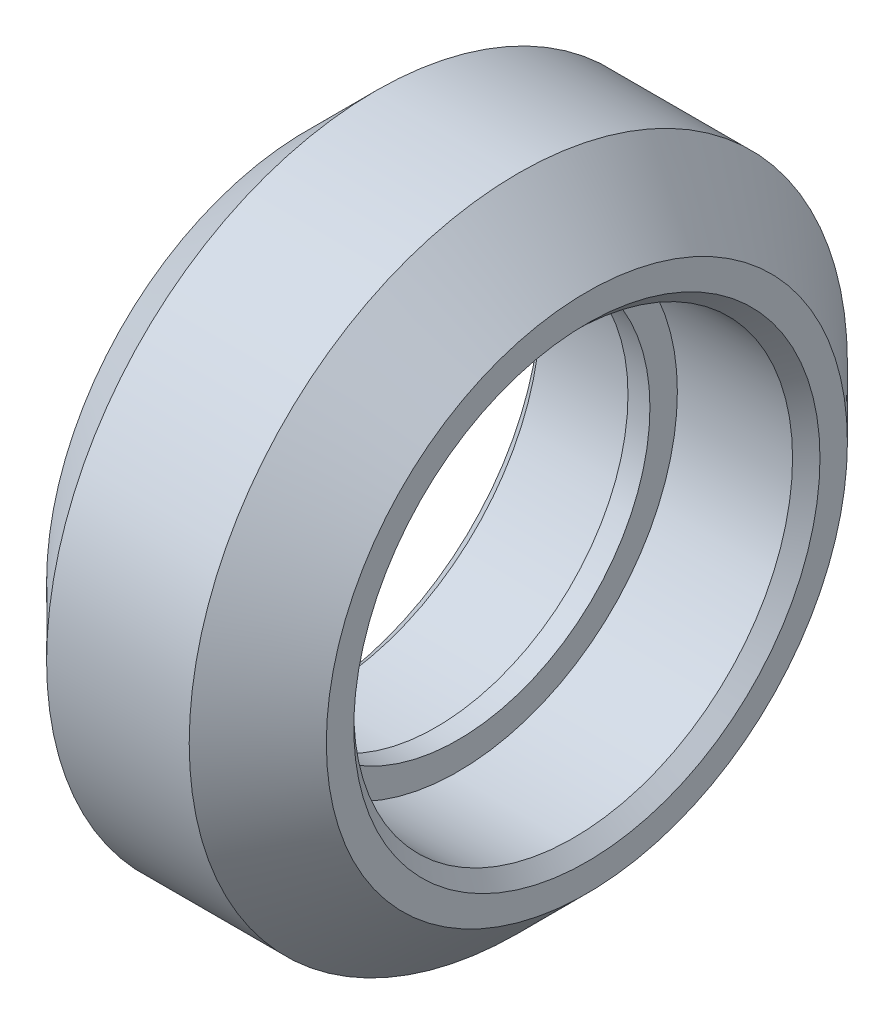
ISO-10303-21;
HEADER;
FILE_DESCRIPTION(('STEP AP214'),'2;1');
FILE_NAME('part.step','',(''),(''),'','','');
FILE_SCHEMA(('AUTOMOTIVE_DESIGN { 1 0 10303 214 1 1 1 1 }'));
ENDSEC;
DATA;
#1=APPLICATION_CONTEXT('core data for automotive mechanical design processes');
#2=APPLICATION_PROTOCOL_DEFINITION('international standard','automotive_design',2000,#1);
#3=PRODUCT_CONTEXT('',#1,'mechanical');
#4=PRODUCT('Part','Part','',(#3));
#5=PRODUCT_RELATED_PRODUCT_CATEGORY('part','',(#4));
#6=PRODUCT_DEFINITION_FORMATION('','',#4);
#7=PRODUCT_DEFINITION_CONTEXT('part definition',#1,'design');
#8=PRODUCT_DEFINITION('design','',#6,#7);
#9=PRODUCT_DEFINITION_SHAPE('','',#8);
#10=(LENGTH_UNIT() NAMED_UNIT(*) SI_UNIT(.MILLI.,.METRE.));
#11=(NAMED_UNIT(*) PLANE_ANGLE_UNIT() SI_UNIT($,.RADIAN.));
#12=(NAMED_UNIT(*) SI_UNIT($,.STERADIAN.) SOLID_ANGLE_UNIT());
#13=UNCERTAINTY_MEASURE_WITH_UNIT(LENGTH_MEASURE(1.E-05),#10,'distance_accuracy_value','');
#14=(GEOMETRIC_REPRESENTATION_CONTEXT(3) GLOBAL_UNCERTAINTY_ASSIGNED_CONTEXT((#13)) GLOBAL_UNIT_ASSIGNED_CONTEXT((#10,
#11,#12)) REPRESENTATION_CONTEXT('',''));
#15=CARTESIAN_POINT('',(0.,0.,0.));
#16=DIRECTION('',(0.,0.,1.));
#17=DIRECTION('',(1.,0.,0.));
#18=AXIS2_PLACEMENT_3D('',#15,#16,#17);
#19=CARTESIAN_POINT('',(-6.58163061851392,2.72965119199853,-1.24757696488587));
#20=DIRECTION('',(1.,0.,0.));
#21=DIRECTION('',(0.,0.,-1.));
#22=AXIS2_PLACEMENT_3D('',#19,#20,#21);
#23=PLANE('',#22);
#24=CARTESIAN_POINT('',(-6.58163061851392,2.72965119199853,-1.24757696488587));
#25=DIRECTION('',(1.,0.,0.));
#26=DIRECTION('',(0.,0.,-1.));
#27=AXIS2_PLACEMENT_3D('',#24,#25,#26);
#28=CIRCLE('',#27,8.5);
#29=CARTESIAN_POINT('',(-6.58163061851392,2.72965119199853,-9.74757696488587));
#30=VERTEX_POINT('',#29);
#31=EDGE_CURVE('E29',#30,#30,#28,.T.);
#32=ORIENTED_EDGE('',*,*,#31,.T.);
#33=EDGE_LOOP('',(#32));
#34=FACE_BOUND('',#33,.T.);
#35=CARTESIAN_POINT('',(-6.58163061851392,2.72965119199853,-1.24757696488587));
#36=DIRECTION('',(1.,0.,0.));
#37=DIRECTION('',(0.,0.,-1.));
#38=AXIS2_PLACEMENT_3D('',#35,#36,#37);
#39=CIRCLE('',#38,9.49999999999999);
#40=CARTESIAN_POINT('',(-6.58163061851392,2.72965119199853,-10.7475769648859));
#41=VERTEX_POINT('',#40);
#42=EDGE_CURVE('E37',#41,#41,#39,.F.);
#43=ORIENTED_EDGE('',*,*,#42,.T.);
#44=EDGE_LOOP('',(#43));
#45=FACE_BOUND('',#44,.T.);
#46=ADVANCED_FACE('F14',(#34,#45),#23,.F.);
#47=CARTESIAN_POINT('',(3.61836938148608,2.72965119199853,-1.24757696488587));
#48=DIRECTION('',(-1.,0.,0.));
#49=DIRECTION('',(0.,0.,1.));
#50=AXIS2_PLACEMENT_3D('',#47,#48,#49);
#51=CYLINDRICAL_SURFACE('',#50,12.);
#52=CARTESIAN_POINT('',(-4.08163061851391,2.72965119199853,-1.24757696488587));
#53=DIRECTION('',(1.,0.,0.));
#54=DIRECTION('',(0.,0.,-1.));
#55=AXIS2_PLACEMENT_3D('',#52,#53,#54);
#56=CIRCLE('',#55,12.);
#57=CARTESIAN_POINT('',(-4.08163061851391,2.72965119199853,-13.2475769648859));
#58=VERTEX_POINT('',#57);
#59=EDGE_CURVE('E40',#58,#58,#56,.T.);
#60=ORIENTED_EDGE('',*,*,#59,.T.);
#61=EDGE_LOOP('',(#60));
#62=FACE_BOUND('',#61,.T.);
#63=CARTESIAN_POINT('',(1.11836938148607,2.72965119199853,-1.24757696488587));
#64=DIRECTION('',(1.,0.,0.));
#65=DIRECTION('',(0.,0.,-1.));
#66=AXIS2_PLACEMENT_3D('',#63,#64,#65);
#67=CIRCLE('',#66,12.);
#68=CARTESIAN_POINT('',(1.11836938148607,2.72965119199853,-13.2475769648859));
#69=VERTEX_POINT('',#68);
#70=EDGE_CURVE('E43',#69,#69,#67,.F.);
#71=ORIENTED_EDGE('',*,*,#70,.T.);
#72=EDGE_LOOP('',(#71));
#73=FACE_BOUND('',#72,.T.);
#74=ADVANCED_FACE('F76',(#62,#73),#51,.T.);
#75=CARTESIAN_POINT('',(3.61836938148608,2.72965119199853,-1.24757696488587));
#76=DIRECTION('',(1.,0.,0.));
#77=DIRECTION('',(0.,0.,-1.));
#78=AXIS2_PLACEMENT_3D('',#75,#76,#77);
#79=PLANE('',#78);
#80=CARTESIAN_POINT('',(3.61836938148608,2.72965119199853,-1.24757696488587));
#81=DIRECTION('',(1.,0.,0.));
#82=DIRECTION('',(0.,0.,-1.));
#83=AXIS2_PLACEMENT_3D('',#80,#81,#82);
#84=CIRCLE('',#83,8.5);
#85=CARTESIAN_POINT('',(3.61836938148608,2.72965119199853,-9.74757696488587));
#86=VERTEX_POINT('',#85);
#87=EDGE_CURVE('E9',#86,#86,#84,.F.);
#88=ORIENTED_EDGE('',*,*,#87,.T.);
#89=EDGE_LOOP('',(#88));
#90=FACE_BOUND('',#89,.T.);
#91=CARTESIAN_POINT('',(3.61836938148608,2.72965119199853,-1.24757696488587));
#92=DIRECTION('',(1.,0.,0.));
#93=DIRECTION('',(0.,0.,-1.));
#94=AXIS2_PLACEMENT_3D('',#91,#92,#93);
#95=CIRCLE('',#94,9.49999999999998);
#96=CARTESIAN_POINT('',(3.61836938148608,2.72965119199853,-10.7475769648858));
#97=VERTEX_POINT('',#96);
#98=EDGE_CURVE('E34',#97,#97,#95,.T.);
#99=ORIENTED_EDGE('',*,*,#98,.T.);
#100=EDGE_LOOP('',(#99));
#101=FACE_BOUND('',#100,.T.);
#102=ADVANCED_FACE('F70',(#90,#101),#79,.T.);
#103=CARTESIAN_POINT('',(-1.08163061851392,2.72965119199853,-1.24757696488587));
#104=DIRECTION('',(1.,0.,0.));
#105=DIRECTION('',(0.,0.,-1.));
#106=AXIS2_PLACEMENT_3D('',#103,#104,#105);
#107=CYLINDRICAL_SURFACE('',#106,8.);
#108=CARTESIAN_POINT('',(3.11836938148608,2.72965119199853,-1.24757696488587));
#109=DIRECTION('',(1.,0.,0.));
#110=DIRECTION('',(0.,0.,-1.));
#111=AXIS2_PLACEMENT_3D('',#108,#109,#110);
#112=CIRCLE('',#111,8.);
#113=CARTESIAN_POINT('',(3.11836938148608,2.72965119199853,-9.24757696488587));
#114=VERTEX_POINT('',#113);
#115=EDGE_CURVE('E21',#114,#114,#112,.T.);
#116=ORIENTED_EDGE('',*,*,#115,.T.);
#117=EDGE_LOOP('',(#116));
#118=FACE_BOUND('',#117,.T.);
#119=CARTESIAN_POINT('',(-1.08163061851392,2.72965119199853,-1.24757696488587));
#120=DIRECTION('',(1.,0.,0.));
#121=DIRECTION('',(0.,0.,-1.));
#122=AXIS2_PLACEMENT_3D('',#119,#120,#121);
#123=CIRCLE('',#122,8.);
#124=CARTESIAN_POINT('',(-1.08163061851392,2.72965119199853,-9.24757696488587));
#125=VERTEX_POINT('',#124);
#126=EDGE_CURVE('E46',#125,#125,#123,.T.);
#127=ORIENTED_EDGE('',*,*,#126,.F.);
#128=EDGE_LOOP('',(#127));
#129=FACE_BOUND('',#128,.T.);
#130=ADVANCED_FACE('F65',(#118,#129),#107,.F.);
#131=CARTESIAN_POINT('',(-1.08163061851392,2.72965119199853,-1.24757696488587));
#132=DIRECTION('',(1.,0.,0.));
#133=DIRECTION('',(0.,0.,-1.));
#134=AXIS2_PLACEMENT_3D('',#131,#132,#133);
#135=PLANE('',#134);
#136=CARTESIAN_POINT('',(-1.08163061851392,2.72965119199853,-1.24757696488587));
#137=DIRECTION('',(1.,0.,0.));
#138=DIRECTION('',(0.,0.,-1.));
#139=AXIS2_PLACEMENT_3D('',#136,#137,#138);
#140=CIRCLE('',#139,7.);
#141=CARTESIAN_POINT('',(-1.08163061851392,2.72965119199853,-8.24757696488587));
#142=VERTEX_POINT('',#141);
#143=EDGE_CURVE('E51',#142,#142,#140,.T.);
#144=ORIENTED_EDGE('',*,*,#143,.F.);
#145=EDGE_LOOP('',(#144));
#146=FACE_BOUND('',#145,.T.);
#147=ORIENTED_EDGE('',*,*,#126,.T.);
#148=EDGE_LOOP('',(#147));
#149=FACE_BOUND('',#148,.T.);
#150=ADVANCED_FACE('F61',(#146,#149),#135,.T.);
#151=CARTESIAN_POINT('',(-1.88163061851392,2.72965119199853,-1.24757696488587));
#152=DIRECTION('',(-1.,0.,0.));
#153=DIRECTION('',(0.,0.,1.));
#154=AXIS2_PLACEMENT_3D('',#151,#152,#153);
#155=CYLINDRICAL_SURFACE('',#154,8.);
#156=CARTESIAN_POINT('',(-6.08163061851391,2.72965119199853,-1.24757696488587));
#157=DIRECTION('',(1.,0.,0.));
#158=DIRECTION('',(0.,0.,-1.));
#159=AXIS2_PLACEMENT_3D('',#156,#157,#158);
#160=CIRCLE('',#159,8.);
#161=CARTESIAN_POINT('',(-6.08163061851391,2.72965119199853,-9.24757696488587));
#162=VERTEX_POINT('',#161);
#163=EDGE_CURVE('E25',#162,#162,#160,.F.);
#164=ORIENTED_EDGE('',*,*,#163,.T.);
#165=EDGE_LOOP('',(#164));
#166=FACE_BOUND('',#165,.T.);
#167=CARTESIAN_POINT('',(-1.88163061851392,2.72965119199853,-1.24757696488587));
#168=DIRECTION('',(1.,0.,0.));
#169=DIRECTION('',(0.,0.,-1.));
#170=AXIS2_PLACEMENT_3D('',#167,#168,#169);
#171=CIRCLE('',#170,8.);
#172=CARTESIAN_POINT('',(-1.88163061851392,2.72965119199853,-9.24757696488587));
#173=VERTEX_POINT('',#172);
#174=EDGE_CURVE('E50',#173,#173,#171,.T.);
#175=ORIENTED_EDGE('',*,*,#174,.T.);
#176=EDGE_LOOP('',(#175));
#177=FACE_BOUND('',#176,.T.);
#178=ADVANCED_FACE('F64',(#166,#177),#155,.F.);
#179=CARTESIAN_POINT('',(-1.88163061851392,2.72965119199853,-1.24757696488587));
#180=DIRECTION('',(-1.,0.,0.));
#181=DIRECTION('',(0.,0.,-1.));
#182=AXIS2_PLACEMENT_3D('',#179,#180,#181);
#183=PLANE('',#182);
#184=CARTESIAN_POINT('',(-1.88163061851392,2.72965119199853,-1.24757696488587));
#185=DIRECTION('',(-1.,0.,0.));
#186=DIRECTION('',(0.,0.,1.));
#187=AXIS2_PLACEMENT_3D('',#184,#185,#186);
#188=CIRCLE('',#187,7.);
#189=CARTESIAN_POINT('',(-1.88163061851392,2.72965119199853,5.75242303511413));
#190=VERTEX_POINT('',#189);
#191=EDGE_CURVE('E47',#190,#190,#188,.T.);
#192=ORIENTED_EDGE('',*,*,#191,.F.);
#193=EDGE_LOOP('',(#192));
#194=FACE_BOUND('',#193,.T.);
#195=ORIENTED_EDGE('',*,*,#174,.F.);
#196=EDGE_LOOP('',(#195));
#197=FACE_BOUND('',#196,.T.);
#198=ADVANCED_FACE('F108',(#194,#197),#183,.T.);
#199=CARTESIAN_POINT('',(-4.08163061851392,2.72965119199853,-1.24757696488587));
#200=DIRECTION('',(1.,0.,0.));
#201=DIRECTION('',(0.,0.,-1.));
#202=AXIS2_PLACEMENT_3D('',#199,#200,#201);
#203=CYLINDRICAL_SURFACE('',#202,7.);
#204=ORIENTED_EDGE('',*,*,#191,.T.);
#205=EDGE_LOOP('',(#204));
#206=FACE_BOUND('',#205,.T.);
#207=ORIENTED_EDGE('',*,*,#143,.T.);
#208=EDGE_LOOP('',(#207));
#209=FACE_BOUND('',#208,.T.);
#210=ADVANCED_FACE('F59',(#206,#209),#203,.F.);
#211=CARTESIAN_POINT('',(-4.08163061851391,2.72965119199853,-1.24757696488587));
#212=DIRECTION('',(1.,0.,0.));
#213=DIRECTION('',(0.,0.,-1.));
#214=AXIS2_PLACEMENT_3D('',#211,#212,#213);
#215=CONICAL_SURFACE('',#214,12.,0.785398163397448);
#216=ORIENTED_EDGE('',*,*,#42,.F.);
#217=EDGE_LOOP('',(#216));
#218=FACE_BOUND('',#217,.T.);
#219=ORIENTED_EDGE('',*,*,#59,.F.);
#220=EDGE_LOOP('',(#219));
#221=FACE_BOUND('',#220,.T.);
#222=ADVANCED_FACE('F88',(#218,#221),#215,.T.);
#223=CARTESIAN_POINT('',(3.61836938148608,2.72965119199853,-1.24757696488587));
#224=DIRECTION('',(-1.,0.,0.));
#225=DIRECTION('',(0.,0.,1.));
#226=AXIS2_PLACEMENT_3D('',#223,#224,#225);
#227=CONICAL_SURFACE('',#226,9.49999999999998,0.785398163397449);
#228=ORIENTED_EDGE('',*,*,#70,.F.);
#229=EDGE_LOOP('',(#228));
#230=FACE_BOUND('',#229,.T.);
#231=ORIENTED_EDGE('',*,*,#98,.F.);
#232=EDGE_LOOP('',(#231));
#233=FACE_BOUND('',#232,.T.);
#234=ADVANCED_FACE('F91',(#230,#233),#227,.T.);
#235=CARTESIAN_POINT('',(-6.58163061851392,2.72965119199853,-1.24757696488587));
#236=DIRECTION('',(-1.,0.,0.));
#237=DIRECTION('',(0.,0.,1.));
#238=AXIS2_PLACEMENT_3D('',#235,#236,#237);
#239=CONICAL_SURFACE('',#238,8.5,0.785398163397445);
#240=ORIENTED_EDGE('',*,*,#163,.F.);
#241=EDGE_LOOP('',(#240));
#242=FACE_BOUND('',#241,.T.);
#243=ORIENTED_EDGE('',*,*,#31,.F.);
#244=EDGE_LOOP('',(#243));
#245=FACE_BOUND('',#244,.T.);
#246=ADVANCED_FACE('F94',(#242,#245),#239,.F.);
#247=CARTESIAN_POINT('',(3.11836938148608,2.72965119199853,-1.24757696488587));
#248=DIRECTION('',(1.,0.,0.));
#249=DIRECTION('',(0.,0.,-1.));
#250=AXIS2_PLACEMENT_3D('',#247,#248,#249);
#251=CONICAL_SURFACE('',#250,8.,0.785398163397452);
#252=ORIENTED_EDGE('',*,*,#87,.F.);
#253=EDGE_LOOP('',(#252));
#254=FACE_BOUND('',#253,.T.);
#255=ORIENTED_EDGE('',*,*,#115,.F.);
#256=EDGE_LOOP('',(#255));
#257=FACE_BOUND('',#256,.T.);
#258=ADVANCED_FACE('F16',(#254,#257),#251,.F.);
#259=CLOSED_SHELL('',(#46,#74,#102,#130,#150,#178,#198,#210,#222,#234,#246,#258));
#260=MANIFOLD_SOLID_BREP('B1',#259);
#261=ADVANCED_BREP_SHAPE_REPRESENTATION('',(#18,#260),#14);
#262=SHAPE_DEFINITION_REPRESENTATION(#9,#261);
ENDSEC;
END-ISO-10303-21;
